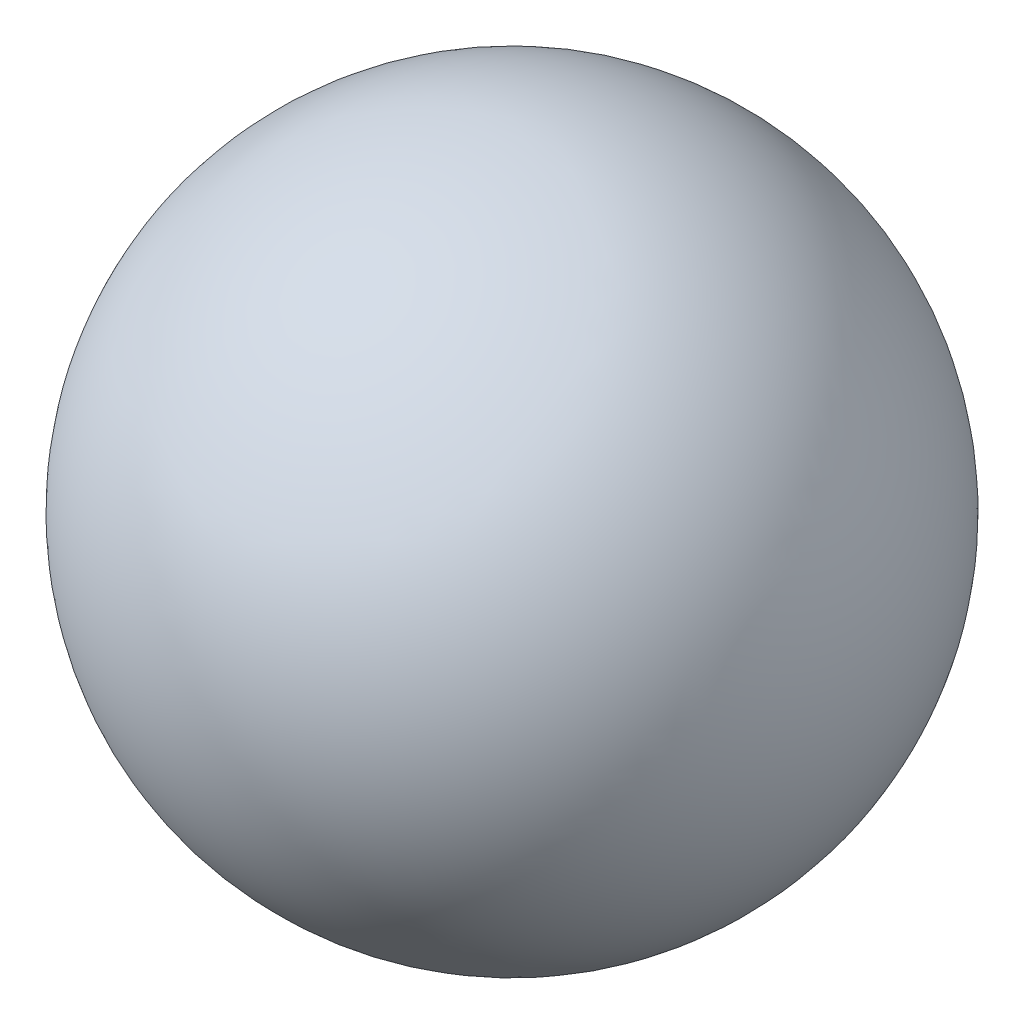
ISO-10303-21;
HEADER;
FILE_DESCRIPTION(('STEP AP214'),'2;1');
FILE_NAME('part.step','',(''),(''),'','','');
FILE_SCHEMA(('AUTOMOTIVE_DESIGN { 1 0 10303 214 1 1 1 1 }'));
ENDSEC;
DATA;
#1=APPLICATION_CONTEXT('core data for automotive mechanical design processes');
#2=APPLICATION_PROTOCOL_DEFINITION('international standard','automotive_design',2000,#1);
#3=PRODUCT_CONTEXT('',#1,'mechanical');
#4=PRODUCT('Part','Part','',(#3));
#5=PRODUCT_RELATED_PRODUCT_CATEGORY('part','',(#4));
#6=PRODUCT_DEFINITION_FORMATION('','',#4);
#7=PRODUCT_DEFINITION_CONTEXT('part definition',#1,'design');
#8=PRODUCT_DEFINITION('design','',#6,#7);
#9=PRODUCT_DEFINITION_SHAPE('','',#8);
#10=(LENGTH_UNIT() NAMED_UNIT(*) SI_UNIT(.MILLI.,.METRE.));
#11=(NAMED_UNIT(*) PLANE_ANGLE_UNIT() SI_UNIT($,.RADIAN.));
#12=(NAMED_UNIT(*) SI_UNIT($,.STERADIAN.) SOLID_ANGLE_UNIT());
#13=UNCERTAINTY_MEASURE_WITH_UNIT(LENGTH_MEASURE(1.E-05),#10,'distance_accuracy_value','');
#14=(GEOMETRIC_REPRESENTATION_CONTEXT(3) GLOBAL_UNCERTAINTY_ASSIGNED_CONTEXT((#13)) GLOBAL_UNIT_ASSIGNED_CONTEXT((#10,
#11,#12)) REPRESENTATION_CONTEXT('',''));
#15=CARTESIAN_POINT('',(0.,0.,0.));
#16=DIRECTION('',(0.,0.,1.));
#17=DIRECTION('',(1.,0.,0.));
#18=AXIS2_PLACEMENT_3D('',#15,#16,#17);
#19=CARTESIAN_POINT('',(0.,0.,0.));
#20=DIRECTION('',(-1.,0.,0.));
#21=DIRECTION('',(0.,0.,-1.));
#22=AXIS2_PLACEMENT_3D('',#19,#20,#21);
#23=SPHERICAL_SURFACE('',#22,3.2);
#24=CARTESIAN_POINT('',(-3.2,0.,0.));
#25=VERTEX_POINT('',#24);
#26=VERTEX_LOOP('',#25);
#27=FACE_BOUND('',#26,.T.);
#28=ADVANCED_FACE('F37',(#27),#23,.T.);
#29=CLOSED_SHELL('',(#28));
#30=MANIFOLD_SOLID_BREP('B2',#29);
#31=ADVANCED_BREP_SHAPE_REPRESENTATION('',(#18,#30),#14);
#32=SHAPE_DEFINITION_REPRESENTATION(#9,#31);
ENDSEC;
END-ISO-10303-21;
